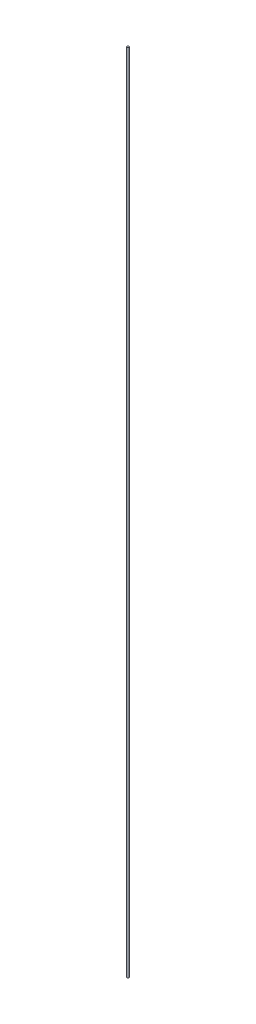
ISO-10303-21;
HEADER;
FILE_DESCRIPTION(('STEP AP214'),'2;1');
FILE_NAME('part.step','',(''),(''),'','','');
FILE_SCHEMA(('AUTOMOTIVE_DESIGN { 1 0 10303 214 1 1 1 1 }'));
ENDSEC;
DATA;
#1=APPLICATION_CONTEXT('core data for automotive mechanical design processes');
#2=APPLICATION_PROTOCOL_DEFINITION('international standard','automotive_design',2000,#1);
#3=PRODUCT_CONTEXT('',#1,'mechanical');
#4=PRODUCT('Part','Part','',(#3));
#5=PRODUCT_RELATED_PRODUCT_CATEGORY('part','',(#4));
#6=PRODUCT_DEFINITION_FORMATION('','',#4);
#7=PRODUCT_DEFINITION_CONTEXT('part definition',#1,'design');
#8=PRODUCT_DEFINITION('design','',#6,#7);
#9=PRODUCT_DEFINITION_SHAPE('','',#8);
#10=(LENGTH_UNIT() NAMED_UNIT(*) SI_UNIT(.MILLI.,.METRE.));
#11=(NAMED_UNIT(*) PLANE_ANGLE_UNIT() SI_UNIT($,.RADIAN.));
#12=(NAMED_UNIT(*) SI_UNIT($,.STERADIAN.) SOLID_ANGLE_UNIT());
#13=UNCERTAINTY_MEASURE_WITH_UNIT(LENGTH_MEASURE(1.E-05),#10,'distance_accuracy_value','');
#14=(GEOMETRIC_REPRESENTATION_CONTEXT(3) GLOBAL_UNCERTAINTY_ASSIGNED_CONTEXT((#13)) GLOBAL_UNIT_ASSIGNED_CONTEXT((#10,
#11,#12)) REPRESENTATION_CONTEXT('',''));
#15=CARTESIAN_POINT('',(0.,0.,0.));
#16=DIRECTION('',(0.,0.,1.));
#17=DIRECTION('',(1.,0.,0.));
#18=AXIS2_PLACEMENT_3D('',#15,#16,#17);
#19=CARTESIAN_POINT('',(0.,800.,0.));
#20=DIRECTION('',(0.,-1.,0.));
#21=DIRECTION('',(0.,0.,-1.));
#22=AXIS2_PLACEMENT_3D('',#19,#20,#21);
#23=CYLINDRICAL_SURFACE('',#22,1.);
#24=CARTESIAN_POINT('',(0.,800.,0.));
#25=DIRECTION('',(0.,1.,0.));
#26=DIRECTION('',(0.,0.,1.));
#27=AXIS2_PLACEMENT_3D('',#24,#25,#26);
#28=CIRCLE('',#27,1.);
#29=CARTESIAN_POINT('',(0.,800.,1.));
#30=VERTEX_POINT('',#29);
#31=EDGE_CURVE('E10',#30,#30,#28,.T.);
#32=ORIENTED_EDGE('',*,*,#31,.F.);
#33=EDGE_LOOP('',(#32));
#34=FACE_BOUND('',#33,.T.);
#35=CARTESIAN_POINT('',(0.,0.,0.));
#36=DIRECTION('',(0.,1.,0.));
#37=DIRECTION('',(0.,0.,1.));
#38=AXIS2_PLACEMENT_3D('',#35,#36,#37);
#39=CIRCLE('',#38,1.);
#40=CARTESIAN_POINT('',(0.,0.,1.));
#41=VERTEX_POINT('',#40);
#42=EDGE_CURVE('E36',#41,#41,#39,.T.);
#43=ORIENTED_EDGE('',*,*,#42,.T.);
#44=EDGE_LOOP('',(#43));
#45=FACE_BOUND('',#44,.T.);
#46=ADVANCED_FACE('F33',(#34,#45),#23,.T.);
#47=CARTESIAN_POINT('',(0.,800.,0.));
#48=DIRECTION('',(0.,1.,0.));
#49=DIRECTION('',(0.,0.,1.));
#50=AXIS2_PLACEMENT_3D('',#47,#48,#49);
#51=PLANE('',#50);
#52=ORIENTED_EDGE('',*,*,#31,.T.);
#53=EDGE_LOOP('',(#52));
#54=FACE_BOUND('',#53,.T.);
#55=ADVANCED_FACE('F48',(#54),#51,.T.);
#56=CARTESIAN_POINT('',(0.,0.,0.));
#57=DIRECTION('',(0.,1.,0.));
#58=DIRECTION('',(0.,0.,1.));
#59=AXIS2_PLACEMENT_3D('',#56,#57,#58);
#60=PLANE('',#59);
#61=ORIENTED_EDGE('',*,*,#42,.F.);
#62=EDGE_LOOP('',(#61));
#63=FACE_BOUND('',#62,.T.);
#64=ADVANCED_FACE('F46',(#63),#60,.F.);
#65=CLOSED_SHELL('',(#46,#55,#64));
#66=MANIFOLD_SOLID_BREP('B2',#65);
#67=ADVANCED_BREP_SHAPE_REPRESENTATION('',(#18,#66),#14);
#68=SHAPE_DEFINITION_REPRESENTATION(#9,#67);
ENDSEC;
END-ISO-10303-21;
